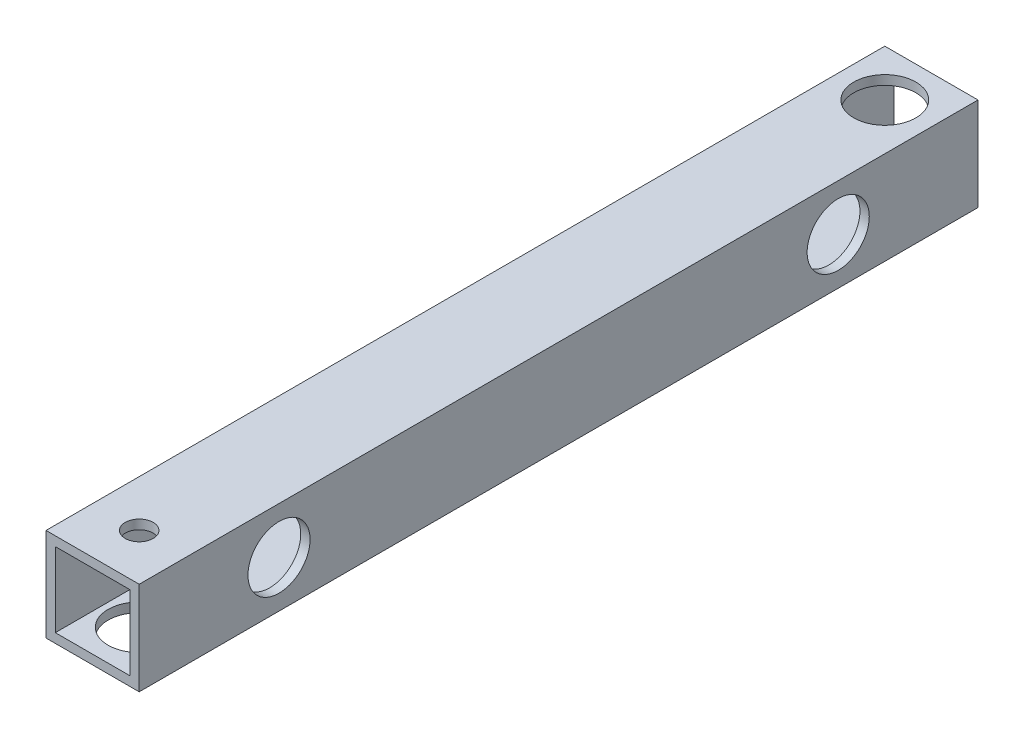
ISO-10303-21;
HEADER;
FILE_DESCRIPTION(('STEP AP214'),'2;1');
FILE_NAME('part.step','',(''),(''),'','','');
FILE_SCHEMA(('AUTOMOTIVE_DESIGN { 1 0 10303 214 1 1 1 1 }'));
ENDSEC;
DATA;
#1=APPLICATION_CONTEXT('core data for automotive mechanical design processes');
#2=APPLICATION_PROTOCOL_DEFINITION('international standard','automotive_design',2000,#1);
#3=PRODUCT_CONTEXT('',#1,'mechanical');
#4=PRODUCT('Part','Part','',(#3));
#5=PRODUCT_RELATED_PRODUCT_CATEGORY('part','',(#4));
#6=PRODUCT_DEFINITION_FORMATION('','',#4);
#7=PRODUCT_DEFINITION_CONTEXT('part definition',#1,'design');
#8=PRODUCT_DEFINITION('design','',#6,#7);
#9=PRODUCT_DEFINITION_SHAPE('','',#8);
#10=(LENGTH_UNIT() NAMED_UNIT(*) SI_UNIT(.MILLI.,.METRE.));
#11=(NAMED_UNIT(*) PLANE_ANGLE_UNIT() SI_UNIT($,.RADIAN.));
#12=(NAMED_UNIT(*) SI_UNIT($,.STERADIAN.) SOLID_ANGLE_UNIT());
#13=UNCERTAINTY_MEASURE_WITH_UNIT(LENGTH_MEASURE(1.E-05),#10,'distance_accuracy_value','');
#14=(GEOMETRIC_REPRESENTATION_CONTEXT(3) GLOBAL_UNCERTAINTY_ASSIGNED_CONTEXT((#13)) GLOBAL_UNIT_ASSIGNED_CONTEXT((#10,
#11,#12)) REPRESENTATION_CONTEXT('',''));
#15=CARTESIAN_POINT('',(0.,0.,0.));
#16=DIRECTION('',(0.,0.,1.));
#17=DIRECTION('',(1.,0.,0.));
#18=AXIS2_PLACEMENT_3D('',#15,#16,#17);
#19=CARTESIAN_POINT('',(0.,0.,135.));
#20=DIRECTION('',(0.,0.,-1.));
#21=DIRECTION('',(-1.,0.,0.));
#22=AXIS2_PLACEMENT_3D('',#19,#20,#21);
#23=PLANE('',#22);
#24=DIRECTION('',(0.,1.,0.));
#25=VECTOR('',#24,1.);
#26=CARTESIAN_POINT('',(7.5,-7.5,135.));
#27=LINE('',#26,#25);
#28=CARTESIAN_POINT('',(7.5,-7.5,135.));
#29=VERTEX_POINT('',#28);
#30=CARTESIAN_POINT('',(7.5,7.5,135.));
#31=VERTEX_POINT('',#30);
#32=EDGE_CURVE('E145',#29,#31,#27,.T.);
#33=ORIENTED_EDGE('',*,*,#32,.T.);
#34=DIRECTION('',(-1.,0.,0.));
#35=VECTOR('',#34,1.);
#36=CARTESIAN_POINT('',(-7.5,7.5,135.));
#37=LINE('',#36,#35);
#38=CARTESIAN_POINT('',(-7.5,7.5,135.));
#39=VERTEX_POINT('',#38);
#40=EDGE_CURVE('E148',#31,#39,#37,.T.);
#41=ORIENTED_EDGE('',*,*,#40,.T.);
#42=DIRECTION('',(0.,-1.,0.));
#43=VECTOR('',#42,1.);
#44=CARTESIAN_POINT('',(-7.5,-7.5,135.));
#45=LINE('',#44,#43);
#46=CARTESIAN_POINT('',(-7.5,-7.5,135.));
#47=VERTEX_POINT('',#46);
#48=EDGE_CURVE('E151',#39,#47,#45,.T.);
#49=ORIENTED_EDGE('',*,*,#48,.T.);
#50=DIRECTION('',(1.,0.,0.));
#51=VECTOR('',#50,1.);
#52=CARTESIAN_POINT('',(-7.5,-7.5,135.));
#53=LINE('',#52,#51);
#54=EDGE_CURVE('E153',#47,#29,#53,.T.);
#55=ORIENTED_EDGE('',*,*,#54,.T.);
#56=EDGE_LOOP('',(#33,#41,#49,#55));
#57=FACE_BOUND('',#56,.T.);
#58=DIRECTION('',(0.,1.,0.));
#59=VECTOR('',#58,1.);
#60=CARTESIAN_POINT('',(6.,-6.,135.));
#61=LINE('',#60,#59);
#62=CARTESIAN_POINT('',(6.,-6.,135.));
#63=VERTEX_POINT('',#62);
#64=CARTESIAN_POINT('',(6.,6.,135.));
#65=VERTEX_POINT('',#64);
#66=EDGE_CURVE('E107',#63,#65,#61,.T.);
#67=ORIENTED_EDGE('',*,*,#66,.F.);
#68=DIRECTION('',(1.,0.,0.));
#69=VECTOR('',#68,1.);
#70=CARTESIAN_POINT('',(-6.,-6.,135.));
#71=LINE('',#70,#69);
#72=CARTESIAN_POINT('',(-6.,-6.,135.));
#73=VERTEX_POINT('',#72);
#74=EDGE_CURVE('E129',#73,#63,#71,.T.);
#75=ORIENTED_EDGE('',*,*,#74,.F.);
#76=DIRECTION('',(0.,-1.,0.));
#77=VECTOR('',#76,1.);
#78=CARTESIAN_POINT('',(-6.,-6.,135.));
#79=LINE('',#78,#77);
#80=CARTESIAN_POINT('',(-6.,6.,135.));
#81=VERTEX_POINT('',#80);
#82=EDGE_CURVE('E127',#81,#73,#79,.T.);
#83=ORIENTED_EDGE('',*,*,#82,.F.);
#84=DIRECTION('',(-1.,0.,0.));
#85=VECTOR('',#84,1.);
#86=CARTESIAN_POINT('',(-6.,6.,135.));
#87=LINE('',#86,#85);
#88=EDGE_CURVE('E115',#65,#81,#87,.T.);
#89=ORIENTED_EDGE('',*,*,#88,.F.);
#90=EDGE_LOOP('',(#67,#75,#83,#89));
#91=FACE_BOUND('',#90,.T.);
#92=ADVANCED_FACE('F40',(#57,#91),#23,.F.);
#93=CARTESIAN_POINT('',(0.,0.,0.));
#94=DIRECTION('',(0.,0.,-1.));
#95=DIRECTION('',(-1.,0.,0.));
#96=AXIS2_PLACEMENT_3D('',#93,#94,#95);
#97=PLANE('',#96);
#98=DIRECTION('',(0.,1.,0.));
#99=VECTOR('',#98,1.);
#100=CARTESIAN_POINT('',(7.5,-7.5,0.));
#101=LINE('',#100,#99);
#102=CARTESIAN_POINT('',(7.5,-7.5,0.));
#103=VERTEX_POINT('',#102);
#104=CARTESIAN_POINT('',(7.5,7.5,0.));
#105=VERTEX_POINT('',#104);
#106=EDGE_CURVE('E123',#103,#105,#101,.T.);
#107=ORIENTED_EDGE('',*,*,#106,.F.);
#108=DIRECTION('',(1.,0.,0.));
#109=VECTOR('',#108,1.);
#110=CARTESIAN_POINT('',(-7.5,-7.5,0.));
#111=LINE('',#110,#109);
#112=CARTESIAN_POINT('',(-7.5,-7.5,0.));
#113=VERTEX_POINT('',#112);
#114=EDGE_CURVE('E149',#113,#103,#111,.T.);
#115=ORIENTED_EDGE('',*,*,#114,.F.);
#116=DIRECTION('',(0.,-1.,0.));
#117=VECTOR('',#116,1.);
#118=CARTESIAN_POINT('',(-7.5,-7.5,0.));
#119=LINE('',#118,#117);
#120=CARTESIAN_POINT('',(-7.5,7.5,0.));
#121=VERTEX_POINT('',#120);
#122=EDGE_CURVE('E160',#121,#113,#119,.T.);
#123=ORIENTED_EDGE('',*,*,#122,.F.);
#124=DIRECTION('',(-1.,0.,0.));
#125=VECTOR('',#124,1.);
#126=CARTESIAN_POINT('',(-7.5,7.5,0.));
#127=LINE('',#126,#125);
#128=EDGE_CURVE('E158',#105,#121,#127,.T.);
#129=ORIENTED_EDGE('',*,*,#128,.F.);
#130=EDGE_LOOP('',(#107,#115,#123,#129));
#131=FACE_BOUND('',#130,.T.);
#132=DIRECTION('',(1.,0.,0.));
#133=VECTOR('',#132,1.);
#134=CARTESIAN_POINT('',(-6.,-6.,0.));
#135=LINE('',#134,#133);
#136=CARTESIAN_POINT('',(-6.,-6.,0.));
#137=VERTEX_POINT('',#136);
#138=CARTESIAN_POINT('',(6.,-6.,0.));
#139=VERTEX_POINT('',#138);
#140=EDGE_CURVE('E116',#137,#139,#135,.T.);
#141=ORIENTED_EDGE('',*,*,#140,.T.);
#142=DIRECTION('',(0.,1.,0.));
#143=VECTOR('',#142,1.);
#144=CARTESIAN_POINT('',(6.,-6.,0.));
#145=LINE('',#144,#143);
#146=CARTESIAN_POINT('',(6.,6.,0.));
#147=VERTEX_POINT('',#146);
#148=EDGE_CURVE('E65',#139,#147,#145,.T.);
#149=ORIENTED_EDGE('',*,*,#148,.T.);
#150=DIRECTION('',(-1.,0.,0.));
#151=VECTOR('',#150,1.);
#152=CARTESIAN_POINT('',(-6.,6.,0.));
#153=LINE('',#152,#151);
#154=CARTESIAN_POINT('',(-6.,6.,0.));
#155=VERTEX_POINT('',#154);
#156=EDGE_CURVE('E122',#147,#155,#153,.T.);
#157=ORIENTED_EDGE('',*,*,#156,.T.);
#158=DIRECTION('',(0.,-1.,0.));
#159=VECTOR('',#158,1.);
#160=CARTESIAN_POINT('',(-6.,-6.,0.));
#161=LINE('',#160,#159);
#162=EDGE_CURVE('E137',#155,#137,#161,.T.);
#163=ORIENTED_EDGE('',*,*,#162,.T.);
#164=EDGE_LOOP('',(#141,#149,#157,#163));
#165=FACE_BOUND('',#164,.T.);
#166=ADVANCED_FACE('F233',(#131,#165),#97,.T.);
#167=CARTESIAN_POINT('',(7.5,-7.5,135.));
#168=DIRECTION('',(-1.,0.,0.));
#169=DIRECTION('',(0.,0.,1.));
#170=AXIS2_PLACEMENT_3D('',#167,#168,#169);
#171=PLANE('',#170);
#172=CARTESIAN_POINT('',(7.5,0.,22.5));
#173=DIRECTION('',(1.,0.,0.));
#174=DIRECTION('',(0.,0.,-1.));
#175=AXIS2_PLACEMENT_3D('',#172,#173,#174);
#176=CIRCLE('',#175,5.);
#177=CARTESIAN_POINT('',(7.5,0.,17.5));
#178=VERTEX_POINT('',#177);
#179=EDGE_CURVE('E190',#178,#178,#176,.T.);
#180=ORIENTED_EDGE('',*,*,#179,.F.);
#181=EDGE_LOOP('',(#180));
#182=FACE_BOUND('',#181,.T.);
#183=CARTESIAN_POINT('',(7.5,0.,112.5));
#184=DIRECTION('',(1.,0.,0.));
#185=DIRECTION('',(0.,0.,-1.));
#186=AXIS2_PLACEMENT_3D('',#183,#184,#185);
#187=CIRCLE('',#186,5.);
#188=CARTESIAN_POINT('',(7.5,0.,107.5));
#189=VERTEX_POINT('',#188);
#190=EDGE_CURVE('E200',#189,#189,#187,.T.);
#191=ORIENTED_EDGE('',*,*,#190,.F.);
#192=EDGE_LOOP('',(#191));
#193=FACE_BOUND('',#192,.T.);
#194=ORIENTED_EDGE('',*,*,#106,.T.);
#195=DIRECTION('',(0.,0.,-1.));
#196=VECTOR('',#195,1.);
#197=CARTESIAN_POINT('',(7.5,7.5,135.));
#198=LINE('',#197,#196);
#199=EDGE_CURVE('E11',#31,#105,#198,.T.);
#200=ORIENTED_EDGE('',*,*,#199,.F.);
#201=ORIENTED_EDGE('',*,*,#32,.F.);
#202=DIRECTION('',(0.,0.,-1.));
#203=VECTOR('',#202,1.);
#204=CARTESIAN_POINT('',(7.5,-7.5,135.));
#205=LINE('',#204,#203);
#206=EDGE_CURVE('E155',#29,#103,#205,.T.);
#207=ORIENTED_EDGE('',*,*,#206,.T.);
#208=EDGE_LOOP('',(#194,#200,#201,#207));
#209=FACE_BOUND('',#208,.T.);
#210=ADVANCED_FACE('F42',(#182,#193,#209),#171,.F.);
#211=CARTESIAN_POINT('',(-7.5,7.5,135.));
#212=DIRECTION('',(0.,-1.,0.));
#213=DIRECTION('',(0.,0.,-1.));
#214=AXIS2_PLACEMENT_3D('',#211,#212,#213);
#215=PLANE('',#214);
#216=CARTESIAN_POINT('',(0.,7.5,7.50000000000001));
#217=DIRECTION('',(0.,1.,0.));
#218=DIRECTION('',(0.,0.,1.));
#219=AXIS2_PLACEMENT_3D('',#216,#217,#218);
#220=CIRCLE('',#219,5.);
#221=CARTESIAN_POINT('',(0.,7.5,12.5));
#222=VERTEX_POINT('',#221);
#223=EDGE_CURVE('E186',#222,#222,#220,.T.);
#224=ORIENTED_EDGE('',*,*,#223,.F.);
#225=EDGE_LOOP('',(#224));
#226=FACE_BOUND('',#225,.T.);
#227=CARTESIAN_POINT('',(0.,7.5,127.5));
#228=DIRECTION('',(0.,1.,0.));
#229=DIRECTION('',(0.,0.,1.));
#230=AXIS2_PLACEMENT_3D('',#227,#228,#229);
#231=CIRCLE('',#230,2.25);
#232=CARTESIAN_POINT('',(0.,7.5,129.75));
#233=VERTEX_POINT('',#232);
#234=EDGE_CURVE('E185',#233,#233,#231,.T.);
#235=ORIENTED_EDGE('',*,*,#234,.F.);
#236=EDGE_LOOP('',(#235));
#237=FACE_BOUND('',#236,.T.);
#238=ORIENTED_EDGE('',*,*,#128,.T.);
#239=DIRECTION('',(0.,0.,-1.));
#240=VECTOR('',#239,1.);
#241=CARTESIAN_POINT('',(-7.5,7.5,135.));
#242=LINE('',#241,#240);
#243=EDGE_CURVE('E49',#39,#121,#242,.T.);
#244=ORIENTED_EDGE('',*,*,#243,.F.);
#245=ORIENTED_EDGE('',*,*,#40,.F.);
#246=ORIENTED_EDGE('',*,*,#199,.T.);
#247=EDGE_LOOP('',(#238,#244,#245,#246));
#248=FACE_BOUND('',#247,.T.);
#249=ADVANCED_FACE('F249',(#226,#237,#248),#215,.F.);
#250=CARTESIAN_POINT('',(-7.5,-7.5,135.));
#251=DIRECTION('',(1.,0.,0.));
#252=DIRECTION('',(0.,0.,-1.));
#253=AXIS2_PLACEMENT_3D('',#250,#251,#252);
#254=PLANE('',#253);
#255=CARTESIAN_POINT('',(-7.5,0.,112.5));
#256=DIRECTION('',(1.,0.,0.));
#257=DIRECTION('',(0.,0.,-1.));
#258=AXIS2_PLACEMENT_3D('',#255,#256,#257);
#259=CIRCLE('',#258,2.7);
#260=CARTESIAN_POINT('',(-7.5,0.,109.8));
#261=VERTEX_POINT('',#260);
#262=EDGE_CURVE('E135',#261,#261,#259,.T.);
#263=ORIENTED_EDGE('',*,*,#262,.T.);
#264=EDGE_LOOP('',(#263));
#265=FACE_BOUND('',#264,.T.);
#266=CARTESIAN_POINT('',(-7.5,0.,22.5));
#267=DIRECTION('',(1.,0.,0.));
#268=DIRECTION('',(0.,0.,-1.));
#269=AXIS2_PLACEMENT_3D('',#266,#267,#268);
#270=CIRCLE('',#269,2.7);
#271=CARTESIAN_POINT('',(-7.5,0.,19.8));
#272=VERTEX_POINT('',#271);
#273=EDGE_CURVE('E173',#272,#272,#270,.T.);
#274=ORIENTED_EDGE('',*,*,#273,.T.);
#275=EDGE_LOOP('',(#274));
#276=FACE_BOUND('',#275,.T.);
#277=ORIENTED_EDGE('',*,*,#122,.T.);
#278=DIRECTION('',(0.,0.,-1.));
#279=VECTOR('',#278,1.);
#280=CARTESIAN_POINT('',(-7.5,-7.5,135.));
#281=LINE('',#280,#279);
#282=EDGE_CURVE('E165',#47,#113,#281,.T.);
#283=ORIENTED_EDGE('',*,*,#282,.F.);
#284=ORIENTED_EDGE('',*,*,#48,.F.);
#285=ORIENTED_EDGE('',*,*,#243,.T.);
#286=EDGE_LOOP('',(#277,#283,#284,#285));
#287=FACE_BOUND('',#286,.T.);
#288=ADVANCED_FACE('F212',(#265,#276,#287),#254,.F.);
#289=CARTESIAN_POINT('',(-7.5,-7.5,135.));
#290=DIRECTION('',(0.,1.,0.));
#291=DIRECTION('',(0.,0.,1.));
#292=AXIS2_PLACEMENT_3D('',#289,#290,#291);
#293=PLANE('',#292);
#294=CARTESIAN_POINT('',(0.,-7.5,127.5));
#295=DIRECTION('',(0.,-1.,0.));
#296=DIRECTION('',(0.,0.,-1.));
#297=AXIS2_PLACEMENT_3D('',#294,#295,#296);
#298=CIRCLE('',#297,5.);
#299=CARTESIAN_POINT('',(0.,-7.5,122.5));
#300=VERTEX_POINT('',#299);
#301=EDGE_CURVE('E320',#300,#300,#298,.T.);
#302=ORIENTED_EDGE('',*,*,#301,.F.);
#303=EDGE_LOOP('',(#302));
#304=FACE_BOUND('',#303,.T.);
#305=CARTESIAN_POINT('',(0.,-7.5,7.50000000000001));
#306=DIRECTION('',(0.,1.,0.));
#307=DIRECTION('',(0.,0.,1.));
#308=AXIS2_PLACEMENT_3D('',#305,#306,#307);
#309=CIRCLE('',#308,2.7);
#310=CARTESIAN_POINT('',(0.,-7.5,10.2));
#311=VERTEX_POINT('',#310);
#312=EDGE_CURVE('E174',#311,#311,#309,.T.);
#313=ORIENTED_EDGE('',*,*,#312,.T.);
#314=EDGE_LOOP('',(#313));
#315=FACE_BOUND('',#314,.T.);
#316=ORIENTED_EDGE('',*,*,#114,.T.);
#317=ORIENTED_EDGE('',*,*,#206,.F.);
#318=ORIENTED_EDGE('',*,*,#54,.F.);
#319=ORIENTED_EDGE('',*,*,#282,.T.);
#320=EDGE_LOOP('',(#316,#317,#318,#319));
#321=FACE_BOUND('',#320,.T.);
#322=ADVANCED_FACE('F244',(#304,#315,#321),#293,.F.);
#323=CARTESIAN_POINT('',(6.,-6.,135.));
#324=DIRECTION('',(-1.,0.,0.));
#325=DIRECTION('',(0.,0.,1.));
#326=AXIS2_PLACEMENT_3D('',#323,#324,#325);
#327=PLANE('',#326);
#328=CARTESIAN_POINT('',(6.,0.,22.5));
#329=DIRECTION('',(-1.,0.,0.));
#330=DIRECTION('',(0.,0.,1.));
#331=AXIS2_PLACEMENT_3D('',#328,#329,#330);
#332=CIRCLE('',#331,5.);
#333=CARTESIAN_POINT('',(6.,0.,27.5));
#334=VERTEX_POINT('',#333);
#335=EDGE_CURVE('E189',#334,#334,#332,.T.);
#336=ORIENTED_EDGE('',*,*,#335,.F.);
#337=EDGE_LOOP('',(#336));
#338=FACE_BOUND('',#337,.T.);
#339=CARTESIAN_POINT('',(6.,0.,112.5));
#340=DIRECTION('',(-1.,0.,0.));
#341=DIRECTION('',(0.,0.,1.));
#342=AXIS2_PLACEMENT_3D('',#339,#340,#341);
#343=CIRCLE('',#342,5.);
#344=CARTESIAN_POINT('',(6.,0.,117.5));
#345=VERTEX_POINT('',#344);
#346=EDGE_CURVE('E187',#345,#345,#343,.T.);
#347=ORIENTED_EDGE('',*,*,#346,.F.);
#348=EDGE_LOOP('',(#347));
#349=FACE_BOUND('',#348,.T.);
#350=ORIENTED_EDGE('',*,*,#148,.F.);
#351=DIRECTION('',(0.,0.,-1.));
#352=VECTOR('',#351,1.);
#353=CARTESIAN_POINT('',(6.,-6.,135.));
#354=LINE('',#353,#352);
#355=EDGE_CURVE('E111',#63,#139,#354,.T.);
#356=ORIENTED_EDGE('',*,*,#355,.F.);
#357=ORIENTED_EDGE('',*,*,#66,.T.);
#358=DIRECTION('',(0.,0.,-1.));
#359=VECTOR('',#358,1.);
#360=CARTESIAN_POINT('',(6.,6.,135.));
#361=LINE('',#360,#359);
#362=EDGE_CURVE('E110',#65,#147,#361,.T.);
#363=ORIENTED_EDGE('',*,*,#362,.T.);
#364=EDGE_LOOP('',(#350,#356,#357,#363));
#365=FACE_BOUND('',#364,.T.);
#366=ADVANCED_FACE('F109',(#338,#349,#365),#327,.T.);
#367=CARTESIAN_POINT('',(-6.,6.,135.));
#368=DIRECTION('',(0.,-1.,0.));
#369=DIRECTION('',(0.,0.,-1.));
#370=AXIS2_PLACEMENT_3D('',#367,#368,#369);
#371=PLANE('',#370);
#372=CARTESIAN_POINT('',(0.,6.,7.50000000000001));
#373=DIRECTION('',(0.,-1.,0.));
#374=DIRECTION('',(0.,0.,-1.));
#375=AXIS2_PLACEMENT_3D('',#372,#373,#374);
#376=CIRCLE('',#375,5.);
#377=CARTESIAN_POINT('',(0.,6.,2.5));
#378=VERTEX_POINT('',#377);
#379=EDGE_CURVE('E182',#378,#378,#376,.T.);
#380=ORIENTED_EDGE('',*,*,#379,.F.);
#381=EDGE_LOOP('',(#380));
#382=FACE_BOUND('',#381,.T.);
#383=CARTESIAN_POINT('',(0.,6.,127.5));
#384=DIRECTION('',(0.,-1.,0.));
#385=DIRECTION('',(0.,0.,-1.));
#386=AXIS2_PLACEMENT_3D('',#383,#384,#385);
#387=CIRCLE('',#386,2.25);
#388=CARTESIAN_POINT('',(0.,6.,125.25));
#389=VERTEX_POINT('',#388);
#390=EDGE_CURVE('E181',#389,#389,#387,.T.);
#391=ORIENTED_EDGE('',*,*,#390,.F.);
#392=EDGE_LOOP('',(#391));
#393=FACE_BOUND('',#392,.T.);
#394=ORIENTED_EDGE('',*,*,#156,.F.);
#395=ORIENTED_EDGE('',*,*,#362,.F.);
#396=ORIENTED_EDGE('',*,*,#88,.T.);
#397=DIRECTION('',(0.,0.,-1.));
#398=VECTOR('',#397,1.);
#399=CARTESIAN_POINT('',(-6.,6.,135.));
#400=LINE('',#399,#398);
#401=EDGE_CURVE('E124',#81,#155,#400,.T.);
#402=ORIENTED_EDGE('',*,*,#401,.T.);
#403=EDGE_LOOP('',(#394,#395,#396,#402));
#404=FACE_BOUND('',#403,.T.);
#405=ADVANCED_FACE('F119',(#382,#393,#404),#371,.T.);
#406=CARTESIAN_POINT('',(-6.,-6.,135.));
#407=DIRECTION('',(1.,0.,0.));
#408=DIRECTION('',(0.,0.,-1.));
#409=AXIS2_PLACEMENT_3D('',#406,#407,#408);
#410=PLANE('',#409);
#411=CARTESIAN_POINT('',(-6.,0.,112.5));
#412=DIRECTION('',(1.,0.,0.));
#413=DIRECTION('',(0.,0.,-1.));
#414=AXIS2_PLACEMENT_3D('',#411,#412,#413);
#415=CIRCLE('',#414,2.7);
#416=CARTESIAN_POINT('',(-6.,0.,109.8));
#417=VERTEX_POINT('',#416);
#418=EDGE_CURVE('E175',#417,#417,#415,.T.);
#419=ORIENTED_EDGE('',*,*,#418,.F.);
#420=EDGE_LOOP('',(#419));
#421=FACE_BOUND('',#420,.T.);
#422=CARTESIAN_POINT('',(-6.,0.,22.5));
#423=DIRECTION('',(1.,0.,0.));
#424=DIRECTION('',(0.,0.,-1.));
#425=AXIS2_PLACEMENT_3D('',#422,#423,#424);
#426=CIRCLE('',#425,2.7);
#427=CARTESIAN_POINT('',(-6.,0.,19.8));
#428=VERTEX_POINT('',#427);
#429=EDGE_CURVE('E170',#428,#428,#426,.T.);
#430=ORIENTED_EDGE('',*,*,#429,.F.);
#431=EDGE_LOOP('',(#430));
#432=FACE_BOUND('',#431,.T.);
#433=ORIENTED_EDGE('',*,*,#162,.F.);
#434=ORIENTED_EDGE('',*,*,#401,.F.);
#435=ORIENTED_EDGE('',*,*,#82,.T.);
#436=DIRECTION('',(0.,0.,-1.));
#437=VECTOR('',#436,1.);
#438=CARTESIAN_POINT('',(-6.,-6.,135.));
#439=LINE('',#438,#437);
#440=EDGE_CURVE('E57',#73,#137,#439,.T.);
#441=ORIENTED_EDGE('',*,*,#440,.T.);
#442=EDGE_LOOP('',(#433,#434,#435,#441));
#443=FACE_BOUND('',#442,.T.);
#444=ADVANCED_FACE('F277',(#421,#432,#443),#410,.T.);
#445=CARTESIAN_POINT('',(-6.,-6.,135.));
#446=DIRECTION('',(0.,1.,0.));
#447=DIRECTION('',(0.,0.,1.));
#448=AXIS2_PLACEMENT_3D('',#445,#446,#447);
#449=PLANE('',#448);
#450=CARTESIAN_POINT('',(0.,-6.,127.5));
#451=DIRECTION('',(0.,1.,0.));
#452=DIRECTION('',(0.,0.,1.));
#453=AXIS2_PLACEMENT_3D('',#450,#451,#452);
#454=CIRCLE('',#453,5.);
#455=CARTESIAN_POINT('',(0.,-6.,132.5));
#456=VERTEX_POINT('',#455);
#457=EDGE_CURVE('E44',#456,#456,#454,.T.);
#458=ORIENTED_EDGE('',*,*,#457,.F.);
#459=EDGE_LOOP('',(#458));
#460=FACE_BOUND('',#459,.T.);
#461=CARTESIAN_POINT('',(0.,-6.,7.50000000000001));
#462=DIRECTION('',(0.,1.,0.));
#463=DIRECTION('',(0.,0.,1.));
#464=AXIS2_PLACEMENT_3D('',#461,#462,#463);
#465=CIRCLE('',#464,2.7);
#466=CARTESIAN_POINT('',(0.,-6.,10.2));
#467=VERTEX_POINT('',#466);
#468=EDGE_CURVE('E178',#467,#467,#465,.T.);
#469=ORIENTED_EDGE('',*,*,#468,.F.);
#470=EDGE_LOOP('',(#469));
#471=FACE_BOUND('',#470,.T.);
#472=ORIENTED_EDGE('',*,*,#140,.F.);
#473=ORIENTED_EDGE('',*,*,#440,.F.);
#474=ORIENTED_EDGE('',*,*,#74,.T.);
#475=ORIENTED_EDGE('',*,*,#355,.T.);
#476=EDGE_LOOP('',(#472,#473,#474,#475));
#477=FACE_BOUND('',#476,.T.);
#478=ADVANCED_FACE('F228',(#460,#471,#477),#449,.T.);
#479=CARTESIAN_POINT('',(-17.5,0.,22.5));
#480=DIRECTION('',(1.,0.,0.));
#481=DIRECTION('',(0.,0.,-1.));
#482=AXIS2_PLACEMENT_3D('',#479,#480,#481);
#483=CYLINDRICAL_SURFACE('',#482,2.7);
#484=ORIENTED_EDGE('',*,*,#429,.T.);
#485=EDGE_LOOP('',(#484));
#486=FACE_BOUND('',#485,.T.);
#487=ORIENTED_EDGE('',*,*,#273,.F.);
#488=EDGE_LOOP('',(#487));
#489=FACE_BOUND('',#488,.T.);
#490=ADVANCED_FACE('F218',(#486,#489),#483,.F.);
#491=CARTESIAN_POINT('',(-17.5,0.,112.5));
#492=DIRECTION('',(1.,0.,0.));
#493=DIRECTION('',(0.,0.,-1.));
#494=AXIS2_PLACEMENT_3D('',#491,#492,#493);
#495=CYLINDRICAL_SURFACE('',#494,2.7);
#496=ORIENTED_EDGE('',*,*,#418,.T.);
#497=EDGE_LOOP('',(#496));
#498=FACE_BOUND('',#497,.T.);
#499=ORIENTED_EDGE('',*,*,#262,.F.);
#500=EDGE_LOOP('',(#499));
#501=FACE_BOUND('',#500,.T.);
#502=ADVANCED_FACE('F215',(#498,#501),#495,.F.);
#503=CARTESIAN_POINT('',(0.,-17.5,7.50000000000001));
#504=DIRECTION('',(0.,1.,0.));
#505=DIRECTION('',(0.,0.,1.));
#506=AXIS2_PLACEMENT_3D('',#503,#504,#505);
#507=CYLINDRICAL_SURFACE('',#506,2.7);
#508=ORIENTED_EDGE('',*,*,#468,.T.);
#509=EDGE_LOOP('',(#508));
#510=FACE_BOUND('',#509,.T.);
#511=ORIENTED_EDGE('',*,*,#312,.F.);
#512=EDGE_LOOP('',(#511));
#513=FACE_BOUND('',#512,.T.);
#514=ADVANCED_FACE('F217',(#510,#513),#507,.F.);
#515=CARTESIAN_POINT('',(0.,-17.5,127.5));
#516=DIRECTION('',(0.,1.,0.));
#517=DIRECTION('',(0.,0.,1.));
#518=AXIS2_PLACEMENT_3D('',#515,#516,#517);
#519=CYLINDRICAL_SURFACE('',#518,2.25);
#520=ORIENTED_EDGE('',*,*,#390,.T.);
#521=EDGE_LOOP('',(#520));
#522=FACE_BOUND('',#521,.T.);
#523=ORIENTED_EDGE('',*,*,#234,.T.);
#524=EDGE_LOOP('',(#523));
#525=FACE_BOUND('',#524,.T.);
#526=ADVANCED_FACE('F225',(#522,#525),#519,.F.);
#527=CARTESIAN_POINT('',(0.,-2.5,7.50000000000001));
#528=DIRECTION('',(0.,1.,0.));
#529=DIRECTION('',(0.,0.,1.));
#530=AXIS2_PLACEMENT_3D('',#527,#528,#529);
#531=CYLINDRICAL_SURFACE('',#530,5.);
#532=ORIENTED_EDGE('',*,*,#379,.T.);
#533=EDGE_LOOP('',(#532));
#534=FACE_BOUND('',#533,.T.);
#535=ORIENTED_EDGE('',*,*,#223,.T.);
#536=EDGE_LOOP('',(#535));
#537=FACE_BOUND('',#536,.T.);
#538=ADVANCED_FACE('F299',(#534,#537),#531,.F.);
#539=CARTESIAN_POINT('',(-2.5,0.,112.5));
#540=DIRECTION('',(1.,0.,0.));
#541=DIRECTION('',(0.,0.,-1.));
#542=AXIS2_PLACEMENT_3D('',#539,#540,#541);
#543=CYLINDRICAL_SURFACE('',#542,5.);
#544=ORIENTED_EDGE('',*,*,#346,.T.);
#545=EDGE_LOOP('',(#544));
#546=FACE_BOUND('',#545,.T.);
#547=ORIENTED_EDGE('',*,*,#190,.T.);
#548=EDGE_LOOP('',(#547));
#549=FACE_BOUND('',#548,.T.);
#550=ADVANCED_FACE('F302',(#546,#549),#543,.F.);
#551=CARTESIAN_POINT('',(-2.5,0.,22.5));
#552=DIRECTION('',(1.,0.,0.));
#553=DIRECTION('',(0.,0.,-1.));
#554=AXIS2_PLACEMENT_3D('',#551,#552,#553);
#555=CYLINDRICAL_SURFACE('',#554,5.);
#556=ORIENTED_EDGE('',*,*,#335,.T.);
#557=EDGE_LOOP('',(#556));
#558=FACE_BOUND('',#557,.T.);
#559=ORIENTED_EDGE('',*,*,#179,.T.);
#560=EDGE_LOOP('',(#559));
#561=FACE_BOUND('',#560,.T.);
#562=ADVANCED_FACE('F308',(#558,#561),#555,.F.);
#563=CARTESIAN_POINT('',(0.,2.5,127.5));
#564=DIRECTION('',(0.,-1.,0.));
#565=DIRECTION('',(0.,0.,-1.));
#566=AXIS2_PLACEMENT_3D('',#563,#564,#565);
#567=CYLINDRICAL_SURFACE('',#566,5.);
#568=ORIENTED_EDGE('',*,*,#457,.T.);
#569=EDGE_LOOP('',(#568));
#570=FACE_BOUND('',#569,.T.);
#571=ORIENTED_EDGE('',*,*,#301,.T.);
#572=EDGE_LOOP('',(#571));
#573=FACE_BOUND('',#572,.T.);
#574=ADVANCED_FACE('F312',(#570,#573),#567,.F.);
#575=CLOSED_SHELL('',(#92,#166,#210,#249,#288,#322,#366,#405,#444,#478,#490,#502,#514,#526,#538,
#550,#562,#574));
#576=MANIFOLD_SOLID_BREP('B2',#575);
#577=ADVANCED_BREP_SHAPE_REPRESENTATION('',(#18,#576),#14);
#578=SHAPE_DEFINITION_REPRESENTATION(#9,#577);
ENDSEC;
END-ISO-10303-21;
